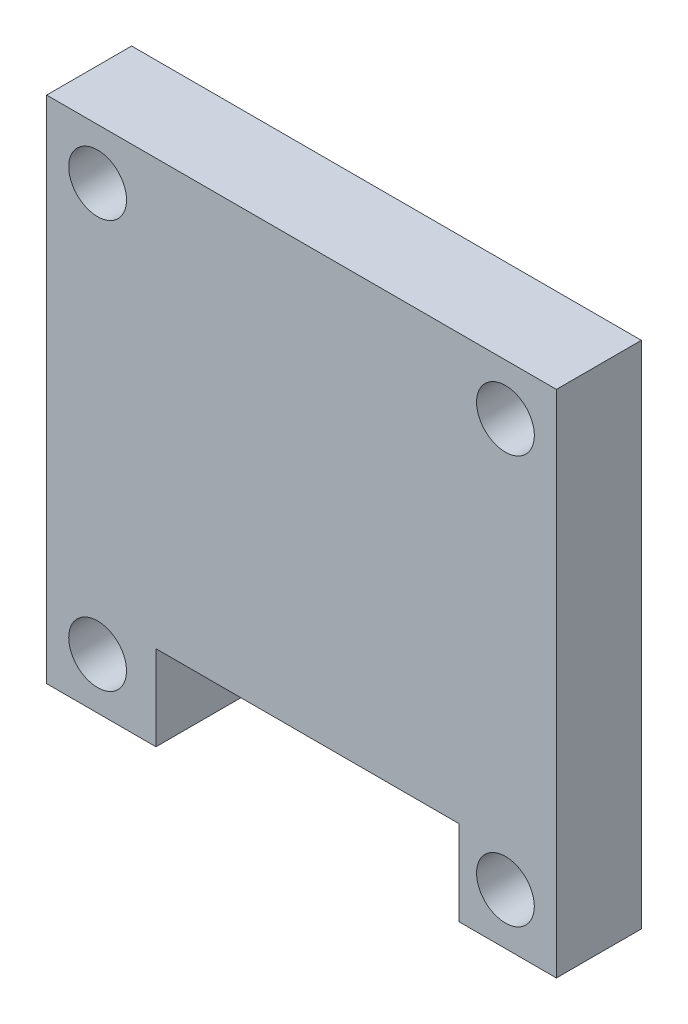
ISO-10303-21;
HEADER;
FILE_DESCRIPTION(('STEP AP214'),'2;1');
FILE_NAME('part.step','',(''),(''),'','','');
FILE_SCHEMA(('AUTOMOTIVE_DESIGN { 1 0 10303 214 1 1 1 1 }'));
ENDSEC;
DATA;
#1=APPLICATION_CONTEXT('core data for automotive mechanical design processes');
#2=APPLICATION_PROTOCOL_DEFINITION('international standard','automotive_design',2000,#1);
#3=PRODUCT_CONTEXT('',#1,'mechanical');
#4=PRODUCT('Part','Part','',(#3));
#5=PRODUCT_RELATED_PRODUCT_CATEGORY('part','',(#4));
#6=PRODUCT_DEFINITION_FORMATION('','',#4);
#7=PRODUCT_DEFINITION_CONTEXT('part definition',#1,'design');
#8=PRODUCT_DEFINITION('design','',#6,#7);
#9=PRODUCT_DEFINITION_SHAPE('','',#8);
#10=(LENGTH_UNIT() NAMED_UNIT(*) SI_UNIT(.MILLI.,.METRE.));
#11=(NAMED_UNIT(*) PLANE_ANGLE_UNIT() SI_UNIT($,.RADIAN.));
#12=(NAMED_UNIT(*) SI_UNIT($,.STERADIAN.) SOLID_ANGLE_UNIT());
#13=UNCERTAINTY_MEASURE_WITH_UNIT(LENGTH_MEASURE(1.E-05),#10,'distance_accuracy_value','');
#14=(GEOMETRIC_REPRESENTATION_CONTEXT(3) GLOBAL_UNCERTAINTY_ASSIGNED_CONTEXT((#13)) GLOBAL_UNIT_ASSIGNED_CONTEXT((#10,
#11,#12)) REPRESENTATION_CONTEXT('',''));
#15=CARTESIAN_POINT('',(0.,0.,0.));
#16=DIRECTION('',(0.,0.,1.));
#17=DIRECTION('',(1.,0.,0.));
#18=AXIS2_PLACEMENT_3D('',#15,#16,#17);
#19=CARTESIAN_POINT('',(0.,0.,5.));
#20=DIRECTION('',(0.,1.,0.));
#21=DIRECTION('',(0.,0.,1.));
#22=AXIS2_PLACEMENT_3D('',#19,#20,#21);
#23=PLANE('',#22);
#24=DIRECTION('',(1.,0.,0.));
#25=VECTOR('',#24,1.);
#26=CARTESIAN_POINT('',(0.,0.,0.));
#27=LINE('',#26,#25);
#28=CARTESIAN_POINT('',(0.,0.,0.));
#29=VERTEX_POINT('',#28);
#30=CARTESIAN_POINT('',(6.43470034297928,0.,0.));
#31=VERTEX_POINT('',#30);
#32=EDGE_CURVE('E182',#29,#31,#27,.T.);
#33=ORIENTED_EDGE('',*,*,#32,.T.);
#34=DIRECTION('',(0.,0.,1.));
#35=VECTOR('',#34,1.);
#36=CARTESIAN_POINT('',(6.43470034297928,0.,0.));
#37=LINE('',#36,#35);
#38=CARTESIAN_POINT('',(6.43470034297928,0.,5.));
#39=VERTEX_POINT('',#38);
#40=EDGE_CURVE('E167',#31,#39,#37,.T.);
#41=ORIENTED_EDGE('',*,*,#40,.T.);
#42=DIRECTION('',(1.,0.,0.));
#43=VECTOR('',#42,1.);
#44=CARTESIAN_POINT('',(0.,0.,5.));
#45=LINE('',#44,#43);
#46=CARTESIAN_POINT('',(0.,0.,5.));
#47=VERTEX_POINT('',#46);
#48=EDGE_CURVE('E220',#47,#39,#45,.T.);
#49=ORIENTED_EDGE('',*,*,#48,.F.);
#50=DIRECTION('',(0.,0.,-1.));
#51=VECTOR('',#50,1.);
#52=CARTESIAN_POINT('',(0.,0.,5.));
#53=LINE('',#52,#51);
#54=EDGE_CURVE('E117',#47,#29,#53,.T.);
#55=ORIENTED_EDGE('',*,*,#54,.T.);
#56=EDGE_LOOP('',(#33,#41,#49,#55));
#57=FACE_BOUND('',#56,.T.);
#58=ADVANCED_FACE('F93',(#57),#23,.F.);
#59=CARTESIAN_POINT('',(0.,0.,5.));
#60=DIRECTION('',(0.,0.,1.));
#61=DIRECTION('',(1.,0.,0.));
#62=AXIS2_PLACEMENT_3D('',#59,#60,#61);
#63=PLANE('',#62);
#64=DIRECTION('',(0.,-1.,0.));
#65=VECTOR('',#64,1.);
#66=CARTESIAN_POINT('',(6.43470034297928,0.,5.));
#67=LINE('',#66,#65);
#68=CARTESIAN_POINT('',(6.43470034297928,5.,5.));
#69=VERTEX_POINT('',#68);
#70=EDGE_CURVE('E173',#69,#39,#67,.T.);
#71=ORIENTED_EDGE('',*,*,#70,.F.);
#72=DIRECTION('',(-1.,0.,0.));
#73=VECTOR('',#72,1.);
#74=CARTESIAN_POINT('',(6.43470034297928,5.,5.));
#75=LINE('',#74,#73);
#76=CARTESIAN_POINT('',(24.2653481866811,5.,5.));
#77=VERTEX_POINT('',#76);
#78=EDGE_CURVE('E184',#77,#69,#75,.T.);
#79=ORIENTED_EDGE('',*,*,#78,.F.);
#80=DIRECTION('',(0.,1.,0.));
#81=VECTOR('',#80,1.);
#82=CARTESIAN_POINT('',(24.2653481866811,0.,5.));
#83=LINE('',#82,#81);
#84=CARTESIAN_POINT('',(24.2653481866811,0.,5.));
#85=VERTEX_POINT('',#84);
#86=EDGE_CURVE('E254',#85,#77,#83,.T.);
#87=ORIENTED_EDGE('',*,*,#86,.F.);
#88=CARTESIAN_POINT('',(30.,0.,5.));
#89=VERTEX_POINT('',#88);
#90=EDGE_CURVE('E144',#85,#89,#45,.T.);
#91=ORIENTED_EDGE('',*,*,#90,.T.);
#92=DIRECTION('',(0.,1.,0.));
#93=VECTOR('',#92,1.);
#94=CARTESIAN_POINT('',(30.,0.,5.));
#95=LINE('',#94,#93);
#96=CARTESIAN_POINT('',(30.,30.,5.));
#97=VERTEX_POINT('',#96);
#98=EDGE_CURVE('E219',#89,#97,#95,.T.);
#99=ORIENTED_EDGE('',*,*,#98,.T.);
#100=DIRECTION('',(1.,0.,0.));
#101=VECTOR('',#100,1.);
#102=CARTESIAN_POINT('',(0.,30.,5.));
#103=LINE('',#102,#101);
#104=CARTESIAN_POINT('',(0.,30.,5.));
#105=VERTEX_POINT('',#104);
#106=EDGE_CURVE('E209',#105,#97,#103,.T.);
#107=ORIENTED_EDGE('',*,*,#106,.F.);
#108=DIRECTION('',(0.,1.,0.));
#109=VECTOR('',#108,1.);
#110=CARTESIAN_POINT('',(0.,0.,5.));
#111=LINE('',#110,#109);
#112=EDGE_CURVE('E194',#47,#105,#111,.T.);
#113=ORIENTED_EDGE('',*,*,#112,.F.);
#114=ORIENTED_EDGE('',*,*,#48,.T.);
#115=EDGE_LOOP('',(#71,#79,#87,#91,#99,#107,#113,#114));
#116=FACE_BOUND('',#115,.T.);
#117=CARTESIAN_POINT('',(27.,27.,5.));
#118=DIRECTION('',(0.,0.,-1.));
#119=DIRECTION('',(-1.,0.,0.));
#120=AXIS2_PLACEMENT_3D('',#117,#118,#119);
#121=CIRCLE('',#120,1.7);
#122=CARTESIAN_POINT('',(25.3,27.,5.));
#123=VERTEX_POINT('',#122);
#124=EDGE_CURVE('E239',#123,#123,#121,.T.);
#125=ORIENTED_EDGE('',*,*,#124,.T.);
#126=EDGE_LOOP('',(#125));
#127=FACE_BOUND('',#126,.T.);
#128=CARTESIAN_POINT('',(3.,27.,5.));
#129=DIRECTION('',(0.,0.,1.));
#130=DIRECTION('',(1.,0.,0.));
#131=AXIS2_PLACEMENT_3D('',#128,#129,#130);
#132=CIRCLE('',#131,1.7);
#133=CARTESIAN_POINT('',(4.7,27.,5.));
#134=VERTEX_POINT('',#133);
#135=EDGE_CURVE('E192',#134,#134,#132,.T.);
#136=ORIENTED_EDGE('',*,*,#135,.F.);
#137=EDGE_LOOP('',(#136));
#138=FACE_BOUND('',#137,.T.);
#139=CARTESIAN_POINT('',(3.,3.,5.));
#140=DIRECTION('',(0.,0.,-1.));
#141=DIRECTION('',(-1.,0.,0.));
#142=AXIS2_PLACEMENT_3D('',#139,#140,#141);
#143=CIRCLE('',#142,1.7);
#144=CARTESIAN_POINT('',(1.3,3.,5.));
#145=VERTEX_POINT('',#144);
#146=EDGE_CURVE('E227',#145,#145,#143,.T.);
#147=ORIENTED_EDGE('',*,*,#146,.T.);
#148=EDGE_LOOP('',(#147));
#149=FACE_BOUND('',#148,.T.);
#150=CARTESIAN_POINT('',(27.,2.99999999999999,5.));
#151=DIRECTION('',(0.,0.,1.));
#152=DIRECTION('',(1.,0.,0.));
#153=AXIS2_PLACEMENT_3D('',#150,#151,#152);
#154=CIRCLE('',#153,1.7);
#155=CARTESIAN_POINT('',(28.7,2.99999999999999,5.));
#156=VERTEX_POINT('',#155);
#157=EDGE_CURVE('E233',#156,#156,#154,.T.);
#158=ORIENTED_EDGE('',*,*,#157,.F.);
#159=EDGE_LOOP('',(#158));
#160=FACE_BOUND('',#159,.T.);
#161=ADVANCED_FACE('F217',(#116,#127,#138,#149,#160),#63,.T.);
#162=CARTESIAN_POINT('',(0.,0.,0.));
#163=DIRECTION('',(0.,0.,1.));
#164=DIRECTION('',(1.,0.,0.));
#165=AXIS2_PLACEMENT_3D('',#162,#163,#164);
#166=PLANE('',#165);
#167=CARTESIAN_POINT('',(27.,27.,0.));
#168=DIRECTION('',(0.,0.,-1.));
#169=DIRECTION('',(-1.,0.,0.));
#170=AXIS2_PLACEMENT_3D('',#167,#168,#169);
#171=CIRCLE('',#170,1.7);
#172=CARTESIAN_POINT('',(25.3,27.,0.));
#173=VERTEX_POINT('',#172);
#174=EDGE_CURVE('E242',#173,#173,#171,.T.);
#175=ORIENTED_EDGE('',*,*,#174,.F.);
#176=EDGE_LOOP('',(#175));
#177=FACE_BOUND('',#176,.T.);
#178=CARTESIAN_POINT('',(3.,3.,0.));
#179=DIRECTION('',(0.,0.,-1.));
#180=DIRECTION('',(-1.,0.,0.));
#181=AXIS2_PLACEMENT_3D('',#178,#179,#180);
#182=CIRCLE('',#181,1.7);
#183=CARTESIAN_POINT('',(1.3,3.,0.));
#184=VERTEX_POINT('',#183);
#185=EDGE_CURVE('E230',#184,#184,#182,.T.);
#186=ORIENTED_EDGE('',*,*,#185,.F.);
#187=EDGE_LOOP('',(#186));
#188=FACE_BOUND('',#187,.T.);
#189=DIRECTION('',(-1.,0.,0.));
#190=VECTOR('',#189,1.);
#191=CARTESIAN_POINT('',(6.43470034297928,5.,0.));
#192=LINE('',#191,#190);
#193=CARTESIAN_POINT('',(24.2653481866811,5.,0.));
#194=VERTEX_POINT('',#193);
#195=CARTESIAN_POINT('',(6.43470034297928,5.,0.));
#196=VERTEX_POINT('',#195);
#197=EDGE_CURVE('E176',#194,#196,#192,.T.);
#198=ORIENTED_EDGE('',*,*,#197,.T.);
#199=DIRECTION('',(0.,-1.,0.));
#200=VECTOR('',#199,1.);
#201=CARTESIAN_POINT('',(6.43470034297928,0.,0.));
#202=LINE('',#201,#200);
#203=EDGE_CURVE('E170',#196,#31,#202,.T.);
#204=ORIENTED_EDGE('',*,*,#203,.T.);
#205=ORIENTED_EDGE('',*,*,#32,.F.);
#206=DIRECTION('',(0.,1.,0.));
#207=VECTOR('',#206,1.);
#208=CARTESIAN_POINT('',(0.,0.,0.));
#209=LINE('',#208,#207);
#210=CARTESIAN_POINT('',(0.,30.,0.));
#211=VERTEX_POINT('',#210);
#212=EDGE_CURVE('E199',#29,#211,#209,.T.);
#213=ORIENTED_EDGE('',*,*,#212,.T.);
#214=DIRECTION('',(1.,0.,0.));
#215=VECTOR('',#214,1.);
#216=CARTESIAN_POINT('',(0.,30.,0.));
#217=LINE('',#216,#215);
#218=CARTESIAN_POINT('',(30.,30.,0.));
#219=VERTEX_POINT('',#218);
#220=EDGE_CURVE('E190',#211,#219,#217,.T.);
#221=ORIENTED_EDGE('',*,*,#220,.T.);
#222=DIRECTION('',(0.,1.,0.));
#223=VECTOR('',#222,1.);
#224=CARTESIAN_POINT('',(30.,0.,0.));
#225=LINE('',#224,#223);
#226=CARTESIAN_POINT('',(30.,0.,0.));
#227=VERTEX_POINT('',#226);
#228=EDGE_CURVE('E186',#227,#219,#225,.T.);
#229=ORIENTED_EDGE('',*,*,#228,.F.);
#230=CARTESIAN_POINT('',(24.2653481866811,0.,0.));
#231=VERTEX_POINT('',#230);
#232=EDGE_CURVE('E187',#231,#227,#27,.T.);
#233=ORIENTED_EDGE('',*,*,#232,.F.);
#234=DIRECTION('',(0.,1.,0.));
#235=VECTOR('',#234,1.);
#236=CARTESIAN_POINT('',(24.2653481866811,0.,0.));
#237=LINE('',#236,#235);
#238=EDGE_CURVE('E108',#231,#194,#237,.T.);
#239=ORIENTED_EDGE('',*,*,#238,.T.);
#240=EDGE_LOOP('',(#198,#204,#205,#213,#221,#229,#233,#239));
#241=FACE_BOUND('',#240,.T.);
#242=CARTESIAN_POINT('',(3.,27.,0.));
#243=DIRECTION('',(0.,0.,1.));
#244=DIRECTION('',(1.,0.,0.));
#245=AXIS2_PLACEMENT_3D('',#242,#243,#244);
#246=CIRCLE('',#245,1.7);
#247=CARTESIAN_POINT('',(4.7,27.,0.));
#248=VERTEX_POINT('',#247);
#249=EDGE_CURVE('E224',#248,#248,#246,.T.);
#250=ORIENTED_EDGE('',*,*,#249,.T.);
#251=EDGE_LOOP('',(#250));
#252=FACE_BOUND('',#251,.T.);
#253=CARTESIAN_POINT('',(27.,2.99999999999999,0.));
#254=DIRECTION('',(0.,0.,1.));
#255=DIRECTION('',(1.,0.,0.));
#256=AXIS2_PLACEMENT_3D('',#253,#254,#255);
#257=CIRCLE('',#256,1.7);
#258=CARTESIAN_POINT('',(28.7,2.99999999999999,0.));
#259=VERTEX_POINT('',#258);
#260=EDGE_CURVE('E236',#259,#259,#257,.T.);
#261=ORIENTED_EDGE('',*,*,#260,.T.);
#262=EDGE_LOOP('',(#261));
#263=FACE_BOUND('',#262,.T.);
#264=ADVANCED_FACE('F179',(#177,#188,#241,#252,#263),#166,.F.);
#265=ORIENTED_EDGE('',*,*,#90,.F.);
#266=DIRECTION('',(0.,0.,1.));
#267=VECTOR('',#266,1.);
#268=CARTESIAN_POINT('',(24.2653481866811,0.,0.));
#269=LINE('',#268,#267);
#270=EDGE_CURVE('E175',#231,#85,#269,.T.);
#271=ORIENTED_EDGE('',*,*,#270,.F.);
#272=ORIENTED_EDGE('',*,*,#232,.T.);
#273=DIRECTION('',(0.,0.,-1.));
#274=VECTOR('',#273,1.);
#275=CARTESIAN_POINT('',(30.,0.,5.));
#276=LINE('',#275,#274);
#277=EDGE_CURVE('E12',#89,#227,#276,.T.);
#278=ORIENTED_EDGE('',*,*,#277,.F.);
#279=EDGE_LOOP('',(#265,#271,#272,#278));
#280=FACE_BOUND('',#279,.T.);
#281=ADVANCED_FACE('F95',(#280),#23,.F.);
#282=CARTESIAN_POINT('',(30.,0.,5.));
#283=DIRECTION('',(-1.,0.,0.));
#284=DIRECTION('',(0.,-1.,0.));
#285=AXIS2_PLACEMENT_3D('',#282,#283,#284);
#286=PLANE('',#285);
#287=ORIENTED_EDGE('',*,*,#228,.T.);
#288=DIRECTION('',(0.,0.,-1.));
#289=VECTOR('',#288,1.);
#290=CARTESIAN_POINT('',(30.,30.,5.));
#291=LINE('',#290,#289);
#292=EDGE_CURVE('E101',#97,#219,#291,.T.);
#293=ORIENTED_EDGE('',*,*,#292,.F.);
#294=ORIENTED_EDGE('',*,*,#98,.F.);
#295=ORIENTED_EDGE('',*,*,#277,.T.);
#296=EDGE_LOOP('',(#287,#293,#294,#295));
#297=FACE_BOUND('',#296,.T.);
#298=ADVANCED_FACE('F212',(#297),#286,.F.);
#299=CARTESIAN_POINT('',(0.,30.,5.));
#300=DIRECTION('',(0.,1.,0.));
#301=DIRECTION('',(0.,0.,1.));
#302=AXIS2_PLACEMENT_3D('',#299,#300,#301);
#303=PLANE('',#302);
#304=ORIENTED_EDGE('',*,*,#220,.F.);
#305=DIRECTION('',(0.,0.,-1.));
#306=VECTOR('',#305,1.);
#307=CARTESIAN_POINT('',(0.,30.,5.));
#308=LINE('',#307,#306);
#309=EDGE_CURVE('E202',#105,#211,#308,.T.);
#310=ORIENTED_EDGE('',*,*,#309,.F.);
#311=ORIENTED_EDGE('',*,*,#106,.T.);
#312=ORIENTED_EDGE('',*,*,#292,.T.);
#313=EDGE_LOOP('',(#304,#310,#311,#312));
#314=FACE_BOUND('',#313,.T.);
#315=ADVANCED_FACE('F207',(#314),#303,.T.);
#316=CARTESIAN_POINT('',(0.,0.,5.));
#317=DIRECTION('',(-1.,0.,0.));
#318=DIRECTION('',(0.,-1.,0.));
#319=AXIS2_PLACEMENT_3D('',#316,#317,#318);
#320=PLANE('',#319);
#321=ORIENTED_EDGE('',*,*,#212,.F.);
#322=ORIENTED_EDGE('',*,*,#54,.F.);
#323=ORIENTED_EDGE('',*,*,#112,.T.);
#324=ORIENTED_EDGE('',*,*,#309,.T.);
#325=EDGE_LOOP('',(#321,#322,#323,#324));
#326=FACE_BOUND('',#325,.T.);
#327=ADVANCED_FACE('F215',(#326),#320,.T.);
#328=CARTESIAN_POINT('',(3.,27.,5.));
#329=DIRECTION('',(0.,0.,-1.));
#330=DIRECTION('',(-1.,0.,0.));
#331=AXIS2_PLACEMENT_3D('',#328,#329,#330);
#332=CYLINDRICAL_SURFACE('',#331,1.7);
#333=ORIENTED_EDGE('',*,*,#135,.T.);
#334=EDGE_LOOP('',(#333));
#335=FACE_BOUND('',#334,.T.);
#336=ORIENTED_EDGE('',*,*,#249,.F.);
#337=EDGE_LOOP('',(#336));
#338=FACE_BOUND('',#337,.T.);
#339=ADVANCED_FACE('F293',(#335,#338),#332,.F.);
#340=CARTESIAN_POINT('',(3.,3.,5.));
#341=DIRECTION('',(0.,0.,-1.));
#342=DIRECTION('',(-1.,0.,0.));
#343=AXIS2_PLACEMENT_3D('',#340,#341,#342);
#344=CYLINDRICAL_SURFACE('',#343,1.7);
#345=ORIENTED_EDGE('',*,*,#146,.F.);
#346=EDGE_LOOP('',(#345));
#347=FACE_BOUND('',#346,.T.);
#348=ORIENTED_EDGE('',*,*,#185,.T.);
#349=EDGE_LOOP('',(#348));
#350=FACE_BOUND('',#349,.T.);
#351=ADVANCED_FACE('F309',(#347,#350),#344,.F.);
#352=CARTESIAN_POINT('',(27.,2.99999999999999,5.));
#353=DIRECTION('',(0.,0.,-1.));
#354=DIRECTION('',(-1.,0.,0.));
#355=AXIS2_PLACEMENT_3D('',#352,#353,#354);
#356=CYLINDRICAL_SURFACE('',#355,1.7);
#357=ORIENTED_EDGE('',*,*,#157,.T.);
#358=EDGE_LOOP('',(#357));
#359=FACE_BOUND('',#358,.T.);
#360=ORIENTED_EDGE('',*,*,#260,.F.);
#361=EDGE_LOOP('',(#360));
#362=FACE_BOUND('',#361,.T.);
#363=ADVANCED_FACE('F316',(#359,#362),#356,.F.);
#364=CARTESIAN_POINT('',(27.,27.,5.));
#365=DIRECTION('',(0.,0.,-1.));
#366=DIRECTION('',(-1.,0.,0.));
#367=AXIS2_PLACEMENT_3D('',#364,#365,#366);
#368=CYLINDRICAL_SURFACE('',#367,1.7);
#369=ORIENTED_EDGE('',*,*,#124,.F.);
#370=EDGE_LOOP('',(#369));
#371=FACE_BOUND('',#370,.T.);
#372=ORIENTED_EDGE('',*,*,#174,.T.);
#373=EDGE_LOOP('',(#372));
#374=FACE_BOUND('',#373,.T.);
#375=ADVANCED_FACE('F271',(#371,#374),#368,.F.);
#376=CARTESIAN_POINT('',(6.43470034297928,0.,0.));
#377=DIRECTION('',(-1.,0.,0.));
#378=DIRECTION('',(0.,0.,1.));
#379=AXIS2_PLACEMENT_3D('',#376,#377,#378);
#380=PLANE('',#379);
#381=ORIENTED_EDGE('',*,*,#70,.T.);
#382=ORIENTED_EDGE('',*,*,#40,.F.);
#383=ORIENTED_EDGE('',*,*,#203,.F.);
#384=DIRECTION('',(0.,0.,1.));
#385=VECTOR('',#384,1.);
#386=CARTESIAN_POINT('',(6.43470034297928,5.,0.));
#387=LINE('',#386,#385);
#388=EDGE_CURVE('E245',#196,#69,#387,.T.);
#389=ORIENTED_EDGE('',*,*,#388,.T.);
#390=EDGE_LOOP('',(#381,#382,#383,#389));
#391=FACE_BOUND('',#390,.T.);
#392=ADVANCED_FACE('F169',(#391),#380,.F.);
#393=CARTESIAN_POINT('',(6.43470034297928,5.,0.));
#394=DIRECTION('',(0.,1.,0.));
#395=DIRECTION('',(0.,0.,1.));
#396=AXIS2_PLACEMENT_3D('',#393,#394,#395);
#397=PLANE('',#396);
#398=ORIENTED_EDGE('',*,*,#78,.T.);
#399=ORIENTED_EDGE('',*,*,#388,.F.);
#400=ORIENTED_EDGE('',*,*,#197,.F.);
#401=DIRECTION('',(0.,0.,1.));
#402=VECTOR('',#401,1.);
#403=CARTESIAN_POINT('',(24.2653481866811,5.,0.));
#404=LINE('',#403,#402);
#405=EDGE_CURVE('E249',#194,#77,#404,.T.);
#406=ORIENTED_EDGE('',*,*,#405,.T.);
#407=EDGE_LOOP('',(#398,#399,#400,#406));
#408=FACE_BOUND('',#407,.T.);
#409=ADVANCED_FACE('F263',(#408),#397,.F.);
#410=CARTESIAN_POINT('',(24.2653481866811,0.,0.));
#411=DIRECTION('',(1.,0.,0.));
#412=DIRECTION('',(0.,0.,-1.));
#413=AXIS2_PLACEMENT_3D('',#410,#411,#412);
#414=PLANE('',#413);
#415=ORIENTED_EDGE('',*,*,#86,.T.);
#416=ORIENTED_EDGE('',*,*,#405,.F.);
#417=ORIENTED_EDGE('',*,*,#238,.F.);
#418=ORIENTED_EDGE('',*,*,#270,.T.);
#419=EDGE_LOOP('',(#415,#416,#417,#418));
#420=FACE_BOUND('',#419,.T.);
#421=ADVANCED_FACE('F260',(#420),#414,.F.);
#422=CLOSED_SHELL('',(#58,#161,#264,#281,#298,#315,#327,#339,#351,#363,#375,#392,#409,#421));
#423=MANIFOLD_SOLID_BREP('B2',#422);
#424=ADVANCED_BREP_SHAPE_REPRESENTATION('',(#18,#423),#14);
#425=SHAPE_DEFINITION_REPRESENTATION(#9,#424);
ENDSEC;
END-ISO-10303-21;
